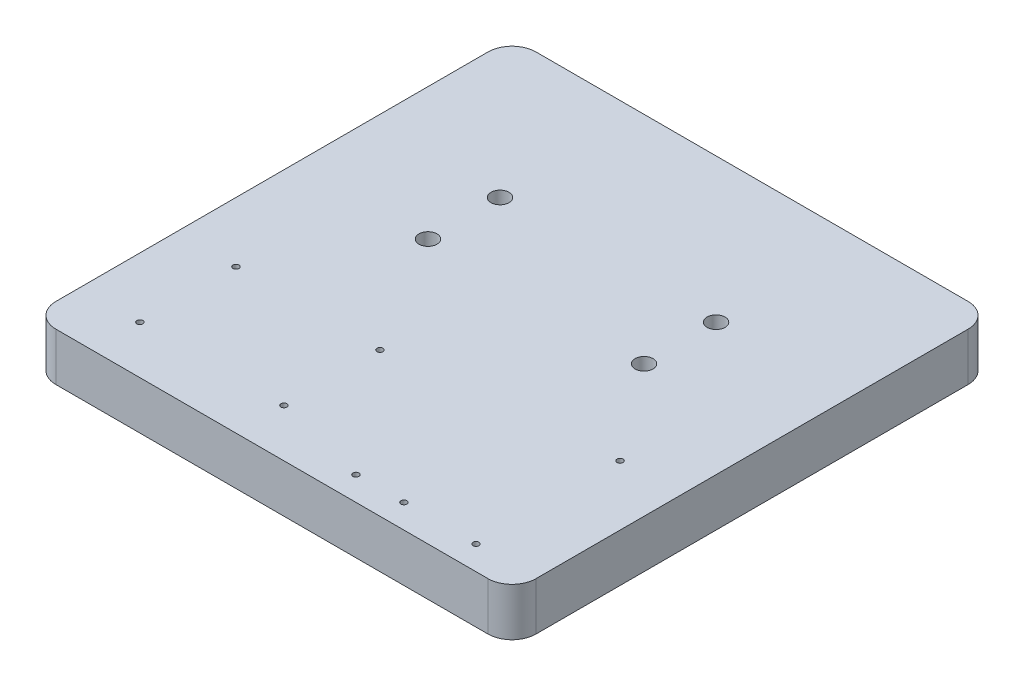
ISO-10303-21;
HEADER;
FILE_DESCRIPTION(('STEP AP214'),'2;1');
FILE_NAME('part.step','',(''),(''),'','','');
FILE_SCHEMA(('AUTOMOTIVE_DESIGN { 1 0 10303 214 1 1 1 1 }'));
ENDSEC;
DATA;
#1=APPLICATION_CONTEXT('core data for automotive mechanical design processes');
#2=APPLICATION_PROTOCOL_DEFINITION('international standard','automotive_design',2000,#1);
#3=PRODUCT_CONTEXT('',#1,'mechanical');
#4=PRODUCT('Part','Part','',(#3));
#5=PRODUCT_RELATED_PRODUCT_CATEGORY('part','',(#4));
#6=PRODUCT_DEFINITION_FORMATION('','',#4);
#7=PRODUCT_DEFINITION_CONTEXT('part definition',#1,'design');
#8=PRODUCT_DEFINITION('design','',#6,#7);
#9=PRODUCT_DEFINITION_SHAPE('','',#8);
#10=(LENGTH_UNIT() NAMED_UNIT(*) SI_UNIT(.MILLI.,.METRE.));
#11=(NAMED_UNIT(*) PLANE_ANGLE_UNIT() SI_UNIT($,.RADIAN.));
#12=(NAMED_UNIT(*) SI_UNIT($,.STERADIAN.) SOLID_ANGLE_UNIT());
#13=UNCERTAINTY_MEASURE_WITH_UNIT(LENGTH_MEASURE(1.E-05),#10,'distance_accuracy_value','');
#14=(GEOMETRIC_REPRESENTATION_CONTEXT(3) GLOBAL_UNCERTAINTY_ASSIGNED_CONTEXT((#13)) GLOBAL_UNIT_ASSIGNED_CONTEXT((#10,
#11,#12)) REPRESENTATION_CONTEXT('',''));
#15=CARTESIAN_POINT('',(0.,0.,0.));
#16=DIRECTION('',(0.,0.,1.));
#17=DIRECTION('',(1.,0.,0.));
#18=AXIS2_PLACEMENT_3D('',#15,#16,#17);
#19=CARTESIAN_POINT('',(100.,20.,100.));
#20=DIRECTION('',(-1.,0.,0.));
#21=DIRECTION('',(0.,0.,1.));
#22=AXIS2_PLACEMENT_3D('',#19,#20,#21);
#23=PLANE('',#22);
#24=DIRECTION('',(0.,0.,-1.));
#25=VECTOR('',#24,1.);
#26=CARTESIAN_POINT('',(100.,20.,100.));
#27=LINE('',#26,#25);
#28=CARTESIAN_POINT('',(100.,20.,90.));
#29=VERTEX_POINT('',#28);
#30=CARTESIAN_POINT('',(100.,20.,-90.));
#31=VERTEX_POINT('',#30);
#32=EDGE_CURVE('E124',#29,#31,#27,.T.);
#33=ORIENTED_EDGE('',*,*,#32,.F.);
#34=DIRECTION('',(0.,-1.,0.));
#35=VECTOR('',#34,1.);
#36=CARTESIAN_POINT('',(100.,20.,90.));
#37=LINE('',#36,#35);
#38=CARTESIAN_POINT('',(100.,0.,90.));
#39=VERTEX_POINT('',#38);
#40=EDGE_CURVE('E150',#29,#39,#37,.T.);
#41=ORIENTED_EDGE('',*,*,#40,.T.);
#42=DIRECTION('',(0.,0.,-1.));
#43=VECTOR('',#42,1.);
#44=CARTESIAN_POINT('',(100.,0.,100.));
#45=LINE('',#44,#43);
#46=CARTESIAN_POINT('',(100.,0.,-90.));
#47=VERTEX_POINT('',#46);
#48=EDGE_CURVE('E156',#39,#47,#45,.T.);
#49=ORIENTED_EDGE('',*,*,#48,.T.);
#50=DIRECTION('',(0.,-1.,0.));
#51=VECTOR('',#50,1.);
#52=CARTESIAN_POINT('',(100.,20.,-90.));
#53=LINE('',#52,#51);
#54=EDGE_CURVE('E148',#47,#31,#53,.F.);
#55=ORIENTED_EDGE('',*,*,#54,.T.);
#56=EDGE_LOOP('',(#33,#41,#49,#55));
#57=FACE_BOUND('',#56,.T.);
#58=ADVANCED_FACE('F32',(#57),#23,.F.);
#59=CARTESIAN_POINT('',(-100.,20.,-100.));
#60=DIRECTION('',(0.,0.,1.));
#61=DIRECTION('',(1.,0.,0.));
#62=AXIS2_PLACEMENT_3D('',#59,#60,#61);
#63=PLANE('',#62);
#64=DIRECTION('',(-1.,0.,0.));
#65=VECTOR('',#64,1.);
#66=CARTESIAN_POINT('',(-100.,20.,-100.));
#67=LINE('',#66,#65);
#68=CARTESIAN_POINT('',(90.,20.,-100.));
#69=VERTEX_POINT('',#68);
#70=CARTESIAN_POINT('',(-90.,20.,-100.));
#71=VERTEX_POINT('',#70);
#72=EDGE_CURVE('E127',#69,#71,#67,.T.);
#73=ORIENTED_EDGE('',*,*,#72,.F.);
#74=DIRECTION('',(0.,-1.,0.));
#75=VECTOR('',#74,1.);
#76=CARTESIAN_POINT('',(90.,20.,-100.));
#77=LINE('',#76,#75);
#78=CARTESIAN_POINT('',(90.,0.,-100.));
#79=VERTEX_POINT('',#78);
#80=EDGE_CURVE('E11',#69,#79,#77,.T.);
#81=ORIENTED_EDGE('',*,*,#80,.T.);
#82=DIRECTION('',(-1.,0.,0.));
#83=VECTOR('',#82,1.);
#84=CARTESIAN_POINT('',(-100.,0.,-100.));
#85=LINE('',#84,#83);
#86=CARTESIAN_POINT('',(-90.,0.,-100.));
#87=VERTEX_POINT('',#86);
#88=EDGE_CURVE('E129',#79,#87,#85,.T.);
#89=ORIENTED_EDGE('',*,*,#88,.T.);
#90=DIRECTION('',(0.,-1.,0.));
#91=VECTOR('',#90,1.);
#92=CARTESIAN_POINT('',(-90.,20.,-100.));
#93=LINE('',#92,#91);
#94=EDGE_CURVE('E40',#87,#71,#93,.F.);
#95=ORIENTED_EDGE('',*,*,#94,.T.);
#96=EDGE_LOOP('',(#73,#81,#89,#95));
#97=FACE_BOUND('',#96,.T.);
#98=ADVANCED_FACE('F281',(#97),#63,.F.);
#99=CARTESIAN_POINT('',(-100.,20.,100.));
#100=DIRECTION('',(1.,0.,0.));
#101=DIRECTION('',(0.,0.,-1.));
#102=AXIS2_PLACEMENT_3D('',#99,#100,#101);
#103=PLANE('',#102);
#104=DIRECTION('',(0.,0.,1.));
#105=VECTOR('',#104,1.);
#106=CARTESIAN_POINT('',(-100.,0.,100.));
#107=LINE('',#106,#105);
#108=CARTESIAN_POINT('',(-100.,0.,-90.));
#109=VERTEX_POINT('',#108);
#110=CARTESIAN_POINT('',(-100.,0.,90.));
#111=VERTEX_POINT('',#110);
#112=EDGE_CURVE('E125',#109,#111,#107,.T.);
#113=ORIENTED_EDGE('',*,*,#112,.T.);
#114=DIRECTION('',(0.,-1.,0.));
#115=VECTOR('',#114,1.);
#116=CARTESIAN_POINT('',(-100.,20.,90.));
#117=LINE('',#116,#115);
#118=CARTESIAN_POINT('',(-100.,20.,90.));
#119=VERTEX_POINT('',#118);
#120=EDGE_CURVE('E103',#111,#119,#117,.F.);
#121=ORIENTED_EDGE('',*,*,#120,.T.);
#122=DIRECTION('',(0.,0.,1.));
#123=VECTOR('',#122,1.);
#124=CARTESIAN_POINT('',(-100.,20.,100.));
#125=LINE('',#124,#123);
#126=CARTESIAN_POINT('',(-100.,20.,-90.));
#127=VERTEX_POINT('',#126);
#128=EDGE_CURVE('E168',#127,#119,#125,.T.);
#129=ORIENTED_EDGE('',*,*,#128,.F.);
#130=DIRECTION('',(0.,-1.,0.));
#131=VECTOR('',#130,1.);
#132=CARTESIAN_POINT('',(-100.,20.,-90.));
#133=LINE('',#132,#131);
#134=EDGE_CURVE('E108',#127,#109,#133,.T.);
#135=ORIENTED_EDGE('',*,*,#134,.T.);
#136=EDGE_LOOP('',(#113,#121,#129,#135));
#137=FACE_BOUND('',#136,.T.);
#138=ADVANCED_FACE('F279',(#137),#103,.F.);
#139=CARTESIAN_POINT('',(-100.,20.,100.));
#140=DIRECTION('',(0.,0.,-1.));
#141=DIRECTION('',(-1.,0.,0.));
#142=AXIS2_PLACEMENT_3D('',#139,#140,#141);
#143=PLANE('',#142);
#144=DIRECTION('',(1.,0.,0.));
#145=VECTOR('',#144,1.);
#146=CARTESIAN_POINT('',(-100.,20.,100.));
#147=LINE('',#146,#145);
#148=CARTESIAN_POINT('',(-90.,20.,100.));
#149=VERTEX_POINT('',#148);
#150=CARTESIAN_POINT('',(90.,20.,100.));
#151=VERTEX_POINT('',#150);
#152=EDGE_CURVE('E118',#149,#151,#147,.T.);
#153=ORIENTED_EDGE('',*,*,#152,.F.);
#154=DIRECTION('',(0.,-1.,0.));
#155=VECTOR('',#154,1.);
#156=CARTESIAN_POINT('',(-90.,20.,100.));
#157=LINE('',#156,#155);
#158=CARTESIAN_POINT('',(-90.,0.,100.));
#159=VERTEX_POINT('',#158);
#160=EDGE_CURVE('E102',#149,#159,#157,.T.);
#161=ORIENTED_EDGE('',*,*,#160,.T.);
#162=DIRECTION('',(1.,0.,0.));
#163=VECTOR('',#162,1.);
#164=CARTESIAN_POINT('',(-100.,0.,100.));
#165=LINE('',#164,#163);
#166=CARTESIAN_POINT('',(90.,0.,100.));
#167=VERTEX_POINT('',#166);
#168=EDGE_CURVE('E115',#159,#167,#165,.T.);
#169=ORIENTED_EDGE('',*,*,#168,.T.);
#170=DIRECTION('',(0.,-1.,0.));
#171=VECTOR('',#170,1.);
#172=CARTESIAN_POINT('',(90.,20.,100.));
#173=LINE('',#172,#171);
#174=EDGE_CURVE('E120',#167,#151,#173,.F.);
#175=ORIENTED_EDGE('',*,*,#174,.T.);
#176=EDGE_LOOP('',(#153,#161,#169,#175));
#177=FACE_BOUND('',#176,.T.);
#178=ADVANCED_FACE('F114',(#177),#143,.F.);
#179=CARTESIAN_POINT('',(0.,20.,0.));
#180=DIRECTION('',(0.,-1.,0.));
#181=DIRECTION('',(0.,0.,-1.));
#182=AXIS2_PLACEMENT_3D('',#179,#180,#181);
#183=PLANE('',#182);
#184=CARTESIAN_POINT('',(75.,20.,30.));
#185=DIRECTION('',(0.,1.,0.));
#186=DIRECTION('',(0.,0.,1.));
#187=AXIS2_PLACEMENT_3D('',#184,#185,#186);
#188=CIRCLE('',#187,1.25);
#189=CARTESIAN_POINT('',(75.,20.,31.25));
#190=VERTEX_POINT('',#189);
#191=EDGE_CURVE('E235',#190,#190,#188,.T.);
#192=ORIENTED_EDGE('',*,*,#191,.F.);
#193=EDGE_LOOP('',(#192));
#194=FACE_BOUND('',#193,.T.);
#195=CARTESIAN_POINT('',(45.,20.,90.));
#196=DIRECTION('',(0.,1.,0.));
#197=DIRECTION('',(0.,0.,1.));
#198=AXIS2_PLACEMENT_3D('',#195,#196,#197);
#199=CIRCLE('',#198,1.25);
#200=CARTESIAN_POINT('',(45.,20.,91.25));
#201=VERTEX_POINT('',#200);
#202=EDGE_CURVE('E229',#201,#201,#199,.T.);
#203=ORIENTED_EDGE('',*,*,#202,.F.);
#204=EDGE_LOOP('',(#203));
#205=FACE_BOUND('',#204,.T.);
#206=CARTESIAN_POINT('',(25.,20.,90.));
#207=DIRECTION('',(0.,1.,0.));
#208=DIRECTION('',(0.,0.,1.));
#209=AXIS2_PLACEMENT_3D('',#206,#207,#208);
#210=CIRCLE('',#209,1.25);
#211=CARTESIAN_POINT('',(25.,20.,91.25));
#212=VERTEX_POINT('',#211);
#213=EDGE_CURVE('E223',#212,#212,#210,.T.);
#214=ORIENTED_EDGE('',*,*,#213,.F.);
#215=EDGE_LOOP('',(#214));
#216=FACE_BOUND('',#215,.T.);
#217=CARTESIAN_POINT('',(-15.,20.,40.));
#218=DIRECTION('',(0.,1.,0.));
#219=DIRECTION('',(0.,0.,1.));
#220=AXIS2_PLACEMENT_3D('',#217,#218,#219);
#221=CIRCLE('',#220,1.25);
#222=CARTESIAN_POINT('',(-15.,20.,41.25));
#223=VERTEX_POINT('',#222);
#224=EDGE_CURVE('E217',#223,#223,#221,.T.);
#225=ORIENTED_EDGE('',*,*,#224,.F.);
#226=EDGE_LOOP('',(#225));
#227=FACE_BOUND('',#226,.T.);
#228=CARTESIAN_POINT('',(-15.,20.,80.));
#229=DIRECTION('',(0.,1.,0.));
#230=DIRECTION('',(0.,0.,1.));
#231=AXIS2_PLACEMENT_3D('',#228,#229,#230);
#232=CIRCLE('',#231,1.25);
#233=CARTESIAN_POINT('',(-15.,20.,81.25));
#234=VERTEX_POINT('',#233);
#235=EDGE_CURVE('E211',#234,#234,#232,.T.);
#236=ORIENTED_EDGE('',*,*,#235,.F.);
#237=EDGE_LOOP('',(#236));
#238=FACE_BOUND('',#237,.T.);
#239=CARTESIAN_POINT('',(-75.,20.,40.));
#240=DIRECTION('',(0.,1.,0.));
#241=DIRECTION('',(0.,0.,-1.));
#242=AXIS2_PLACEMENT_3D('',#239,#240,#241);
#243=CIRCLE('',#242,1.25);
#244=CARTESIAN_POINT('',(-75.,20.,38.75));
#245=VERTEX_POINT('',#244);
#246=EDGE_CURVE('E205',#245,#245,#243,.T.);
#247=ORIENTED_EDGE('',*,*,#246,.F.);
#248=EDGE_LOOP('',(#247));
#249=FACE_BOUND('',#248,.T.);
#250=CARTESIAN_POINT('',(-75.,20.,80.));
#251=DIRECTION('',(0.,1.,0.));
#252=DIRECTION('',(0.,0.,-1.));
#253=AXIS2_PLACEMENT_3D('',#250,#251,#252);
#254=CIRCLE('',#253,1.25);
#255=CARTESIAN_POINT('',(-75.,20.,78.75));
#256=VERTEX_POINT('',#255);
#257=EDGE_CURVE('E199',#256,#256,#254,.T.);
#258=ORIENTED_EDGE('',*,*,#257,.F.);
#259=EDGE_LOOP('',(#258));
#260=FACE_BOUND('',#259,.T.);
#261=CARTESIAN_POINT('',(75.,20.,90.));
#262=DIRECTION('',(0.,1.,0.));
#263=DIRECTION('',(0.,0.,1.));
#264=AXIS2_PLACEMENT_3D('',#261,#262,#263);
#265=CIRCLE('',#264,1.25);
#266=CARTESIAN_POINT('',(75.,20.,91.25));
#267=VERTEX_POINT('',#266);
#268=EDGE_CURVE('E193',#267,#267,#265,.T.);
#269=ORIENTED_EDGE('',*,*,#268,.F.);
#270=EDGE_LOOP('',(#269));
#271=FACE_BOUND('',#270,.T.);
#272=CARTESIAN_POINT('',(45.,20.,-40.));
#273=DIRECTION('',(0.,-1.,0.));
#274=DIRECTION('',(0.,0.,1.));
#275=AXIS2_PLACEMENT_3D('',#272,#273,#274);
#276=CIRCLE('',#275,3.75000000000001);
#277=CARTESIAN_POINT('',(45.,20.,-36.25));
#278=VERTEX_POINT('',#277);
#279=EDGE_CURVE('E187',#278,#278,#276,.T.);
#280=ORIENTED_EDGE('',*,*,#279,.T.);
#281=EDGE_LOOP('',(#280));
#282=FACE_BOUND('',#281,.T.);
#283=CARTESIAN_POINT('',(-45.,20.,-40.));
#284=DIRECTION('',(0.,-1.,0.));
#285=DIRECTION('',(0.,0.,-1.));
#286=AXIS2_PLACEMENT_3D('',#283,#284,#285);
#287=CIRCLE('',#286,3.75000000000001);
#288=CARTESIAN_POINT('',(-45.,20.,-43.75));
#289=VERTEX_POINT('',#288);
#290=EDGE_CURVE('E181',#289,#289,#287,.T.);
#291=ORIENTED_EDGE('',*,*,#290,.T.);
#292=EDGE_LOOP('',(#291));
#293=FACE_BOUND('',#292,.T.);
#294=CARTESIAN_POINT('',(45.,20.,-10.));
#295=DIRECTION('',(0.,1.,0.));
#296=DIRECTION('',(0.,0.,-1.));
#297=AXIS2_PLACEMENT_3D('',#294,#295,#296);
#298=CIRCLE('',#297,3.75000000000001);
#299=CARTESIAN_POINT('',(45.,20.,-13.75));
#300=VERTEX_POINT('',#299);
#301=EDGE_CURVE('E175',#300,#300,#298,.T.);
#302=ORIENTED_EDGE('',*,*,#301,.F.);
#303=EDGE_LOOP('',(#302));
#304=FACE_BOUND('',#303,.T.);
#305=CARTESIAN_POINT('',(-45.,20.,-10.));
#306=DIRECTION('',(0.,1.,0.));
#307=DIRECTION('',(0.,0.,1.));
#308=AXIS2_PLACEMENT_3D('',#305,#306,#307);
#309=CIRCLE('',#308,3.75000000000001);
#310=CARTESIAN_POINT('',(-45.,20.,-6.25));
#311=VERTEX_POINT('',#310);
#312=EDGE_CURVE('E164',#311,#311,#309,.T.);
#313=ORIENTED_EDGE('',*,*,#312,.F.);
#314=EDGE_LOOP('',(#313));
#315=FACE_BOUND('',#314,.T.);
#316=ORIENTED_EDGE('',*,*,#128,.T.);
#317=CARTESIAN_POINT('',(-90.,20.,90.));
#318=DIRECTION('',(0.,-1.,0.));
#319=DIRECTION('',(0.,0.,-1.));
#320=AXIS2_PLACEMENT_3D('',#317,#318,#319);
#321=CIRCLE('',#320,10.);
#322=EDGE_CURVE('E146',#119,#149,#321,.F.);
#323=ORIENTED_EDGE('',*,*,#322,.T.);
#324=ORIENTED_EDGE('',*,*,#152,.T.);
#325=CARTESIAN_POINT('',(90.,20.,90.));
#326=DIRECTION('',(0.,-1.,0.));
#327=DIRECTION('',(0.,0.,-1.));
#328=AXIS2_PLACEMENT_3D('',#325,#326,#327);
#329=CIRCLE('',#328,10.);
#330=EDGE_CURVE('E144',#151,#29,#329,.F.);
#331=ORIENTED_EDGE('',*,*,#330,.T.);
#332=ORIENTED_EDGE('',*,*,#32,.T.);
#333=CARTESIAN_POINT('',(90.,20.,-90.));
#334=DIRECTION('',(0.,-1.,0.));
#335=DIRECTION('',(0.,0.,-1.));
#336=AXIS2_PLACEMENT_3D('',#333,#334,#335);
#337=CIRCLE('',#336,10.);
#338=EDGE_CURVE('E53',#31,#69,#337,.F.);
#339=ORIENTED_EDGE('',*,*,#338,.T.);
#340=ORIENTED_EDGE('',*,*,#72,.T.);
#341=CARTESIAN_POINT('',(-90.,20.,-90.));
#342=DIRECTION('',(0.,-1.,0.));
#343=DIRECTION('',(0.,0.,-1.));
#344=AXIS2_PLACEMENT_3D('',#341,#342,#343);
#345=CIRCLE('',#344,10.);
#346=EDGE_CURVE('E141',#71,#127,#345,.F.);
#347=ORIENTED_EDGE('',*,*,#346,.T.);
#348=EDGE_LOOP('',(#316,#323,#324,#331,#332,#339,#340,#347));
#349=FACE_BOUND('',#348,.T.);
#350=ADVANCED_FACE('F250',(#194,#205,#216,#227,#238,#249,#260,#271,#282,#293,#304,#315,#349),
#183,.F.);
#351=CARTESIAN_POINT('',(0.,0.,0.));
#352=DIRECTION('',(0.,-1.,0.));
#353=DIRECTION('',(0.,0.,-1.));
#354=AXIS2_PLACEMENT_3D('',#351,#352,#353);
#355=PLANE('',#354);
#356=CARTESIAN_POINT('',(75.,0.,30.));
#357=DIRECTION('',(0.,1.,0.));
#358=DIRECTION('',(0.,0.,1.));
#359=AXIS2_PLACEMENT_3D('',#356,#357,#358);
#360=CIRCLE('',#359,1.25);
#361=CARTESIAN_POINT('',(75.,0.,31.25));
#362=VERTEX_POINT('',#361);
#363=EDGE_CURVE('E196',#362,#362,#360,.T.);
#364=ORIENTED_EDGE('',*,*,#363,.T.);
#365=EDGE_LOOP('',(#364));
#366=FACE_BOUND('',#365,.T.);
#367=CARTESIAN_POINT('',(45.,0.,90.));
#368=DIRECTION('',(0.,1.,0.));
#369=DIRECTION('',(0.,0.,1.));
#370=AXIS2_PLACEMENT_3D('',#367,#368,#369);
#371=CIRCLE('',#370,1.25);
#372=CARTESIAN_POINT('',(45.,0.,91.25));
#373=VERTEX_POINT('',#372);
#374=EDGE_CURVE('E232',#373,#373,#371,.T.);
#375=ORIENTED_EDGE('',*,*,#374,.T.);
#376=EDGE_LOOP('',(#375));
#377=FACE_BOUND('',#376,.T.);
#378=CARTESIAN_POINT('',(25.,0.,90.));
#379=DIRECTION('',(0.,1.,0.));
#380=DIRECTION('',(0.,0.,1.));
#381=AXIS2_PLACEMENT_3D('',#378,#379,#380);
#382=CIRCLE('',#381,1.25);
#383=CARTESIAN_POINT('',(25.,0.,91.25));
#384=VERTEX_POINT('',#383);
#385=EDGE_CURVE('E226',#384,#384,#382,.T.);
#386=ORIENTED_EDGE('',*,*,#385,.T.);
#387=EDGE_LOOP('',(#386));
#388=FACE_BOUND('',#387,.T.);
#389=CARTESIAN_POINT('',(-15.,0.,40.));
#390=DIRECTION('',(0.,1.,0.));
#391=DIRECTION('',(0.,0.,1.));
#392=AXIS2_PLACEMENT_3D('',#389,#390,#391);
#393=CIRCLE('',#392,1.25);
#394=CARTESIAN_POINT('',(-15.,0.,41.25));
#395=VERTEX_POINT('',#394);
#396=EDGE_CURVE('E220',#395,#395,#393,.T.);
#397=ORIENTED_EDGE('',*,*,#396,.T.);
#398=EDGE_LOOP('',(#397));
#399=FACE_BOUND('',#398,.T.);
#400=CARTESIAN_POINT('',(-15.,0.,80.));
#401=DIRECTION('',(0.,1.,0.));
#402=DIRECTION('',(0.,0.,1.));
#403=AXIS2_PLACEMENT_3D('',#400,#401,#402);
#404=CIRCLE('',#403,1.25);
#405=CARTESIAN_POINT('',(-15.,0.,81.25));
#406=VERTEX_POINT('',#405);
#407=EDGE_CURVE('E214',#406,#406,#404,.T.);
#408=ORIENTED_EDGE('',*,*,#407,.T.);
#409=EDGE_LOOP('',(#408));
#410=FACE_BOUND('',#409,.T.);
#411=CARTESIAN_POINT('',(-75.,0.,40.));
#412=DIRECTION('',(0.,1.,0.));
#413=DIRECTION('',(0.,0.,-1.));
#414=AXIS2_PLACEMENT_3D('',#411,#412,#413);
#415=CIRCLE('',#414,1.25);
#416=CARTESIAN_POINT('',(-75.,0.,38.75));
#417=VERTEX_POINT('',#416);
#418=EDGE_CURVE('E208',#417,#417,#415,.T.);
#419=ORIENTED_EDGE('',*,*,#418,.T.);
#420=EDGE_LOOP('',(#419));
#421=FACE_BOUND('',#420,.T.);
#422=CARTESIAN_POINT('',(-75.,0.,80.));
#423=DIRECTION('',(0.,1.,0.));
#424=DIRECTION('',(0.,0.,-1.));
#425=AXIS2_PLACEMENT_3D('',#422,#423,#424);
#426=CIRCLE('',#425,1.25);
#427=CARTESIAN_POINT('',(-75.,0.,78.75));
#428=VERTEX_POINT('',#427);
#429=EDGE_CURVE('E202',#428,#428,#426,.T.);
#430=ORIENTED_EDGE('',*,*,#429,.T.);
#431=EDGE_LOOP('',(#430));
#432=FACE_BOUND('',#431,.T.);
#433=CARTESIAN_POINT('',(75.,0.,90.));
#434=DIRECTION('',(0.,1.,0.));
#435=DIRECTION('',(0.,0.,1.));
#436=AXIS2_PLACEMENT_3D('',#433,#434,#435);
#437=CIRCLE('',#436,1.25);
#438=CARTESIAN_POINT('',(75.,0.,91.25));
#439=VERTEX_POINT('',#438);
#440=EDGE_CURVE('E190',#439,#439,#437,.T.);
#441=ORIENTED_EDGE('',*,*,#440,.T.);
#442=EDGE_LOOP('',(#441));
#443=FACE_BOUND('',#442,.T.);
#444=CARTESIAN_POINT('',(45.,0.,-40.));
#445=DIRECTION('',(0.,-1.,0.));
#446=DIRECTION('',(0.,0.,1.));
#447=AXIS2_PLACEMENT_3D('',#444,#445,#446);
#448=CIRCLE('',#447,3.75000000000001);
#449=CARTESIAN_POINT('',(45.,0.,-36.25));
#450=VERTEX_POINT('',#449);
#451=EDGE_CURVE('E184',#450,#450,#448,.T.);
#452=ORIENTED_EDGE('',*,*,#451,.F.);
#453=EDGE_LOOP('',(#452));
#454=FACE_BOUND('',#453,.T.);
#455=CARTESIAN_POINT('',(-45.,0.,-40.));
#456=DIRECTION('',(0.,-1.,0.));
#457=DIRECTION('',(0.,0.,-1.));
#458=AXIS2_PLACEMENT_3D('',#455,#456,#457);
#459=CIRCLE('',#458,3.75000000000001);
#460=CARTESIAN_POINT('',(-45.,0.,-43.75));
#461=VERTEX_POINT('',#460);
#462=EDGE_CURVE('E178',#461,#461,#459,.T.);
#463=ORIENTED_EDGE('',*,*,#462,.F.);
#464=EDGE_LOOP('',(#463));
#465=FACE_BOUND('',#464,.T.);
#466=CARTESIAN_POINT('',(45.,0.,-10.));
#467=DIRECTION('',(0.,1.,0.));
#468=DIRECTION('',(0.,0.,-1.));
#469=AXIS2_PLACEMENT_3D('',#466,#467,#468);
#470=CIRCLE('',#469,3.75000000000001);
#471=CARTESIAN_POINT('',(45.,0.,-13.75));
#472=VERTEX_POINT('',#471);
#473=EDGE_CURVE('E173',#472,#472,#470,.T.);
#474=ORIENTED_EDGE('',*,*,#473,.T.);
#475=EDGE_LOOP('',(#474));
#476=FACE_BOUND('',#475,.T.);
#477=CARTESIAN_POINT('',(-45.,0.,-10.));
#478=DIRECTION('',(0.,1.,0.));
#479=DIRECTION('',(0.,0.,1.));
#480=AXIS2_PLACEMENT_3D('',#477,#478,#479);
#481=CIRCLE('',#480,3.75000000000001);
#482=CARTESIAN_POINT('',(-45.,0.,-6.25));
#483=VERTEX_POINT('',#482);
#484=EDGE_CURVE('E161',#483,#483,#481,.T.);
#485=ORIENTED_EDGE('',*,*,#484,.T.);
#486=EDGE_LOOP('',(#485));
#487=FACE_BOUND('',#486,.T.);
#488=ORIENTED_EDGE('',*,*,#168,.F.);
#489=CARTESIAN_POINT('',(-90.,0.,90.));
#490=DIRECTION('',(0.,-1.,0.));
#491=DIRECTION('',(0.,0.,-1.));
#492=AXIS2_PLACEMENT_3D('',#489,#490,#491);
#493=CIRCLE('',#492,10.);
#494=EDGE_CURVE('E98',#159,#111,#493,.T.);
#495=ORIENTED_EDGE('',*,*,#494,.T.);
#496=ORIENTED_EDGE('',*,*,#112,.F.);
#497=CARTESIAN_POINT('',(-90.,0.,-90.));
#498=DIRECTION('',(0.,-1.,0.));
#499=DIRECTION('',(0.,0.,-1.));
#500=AXIS2_PLACEMENT_3D('',#497,#498,#499);
#501=CIRCLE('',#500,10.);
#502=EDGE_CURVE('E119',#109,#87,#501,.T.);
#503=ORIENTED_EDGE('',*,*,#502,.T.);
#504=ORIENTED_EDGE('',*,*,#88,.F.);
#505=CARTESIAN_POINT('',(90.,0.,-90.));
#506=DIRECTION('',(0.,-1.,0.));
#507=DIRECTION('',(0.,0.,-1.));
#508=AXIS2_PLACEMENT_3D('',#505,#506,#507);
#509=CIRCLE('',#508,10.);
#510=EDGE_CURVE('E135',#79,#47,#509,.T.);
#511=ORIENTED_EDGE('',*,*,#510,.T.);
#512=ORIENTED_EDGE('',*,*,#48,.F.);
#513=CARTESIAN_POINT('',(90.,0.,90.));
#514=DIRECTION('',(0.,-1.,0.));
#515=DIRECTION('',(0.,0.,-1.));
#516=AXIS2_PLACEMENT_3D('',#513,#514,#515);
#517=CIRCLE('',#516,10.);
#518=EDGE_CURVE('E109',#39,#167,#517,.T.);
#519=ORIENTED_EDGE('',*,*,#518,.T.);
#520=EDGE_LOOP('',(#488,#495,#496,#503,#504,#511,#512,#519));
#521=FACE_BOUND('',#520,.T.);
#522=ADVANCED_FACE('F122',(#366,#377,#388,#399,#410,#421,#432,#443,#454,#465,#476,#487,#521),
#355,.T.);
#523=CARTESIAN_POINT('',(-90.,20.,90.));
#524=DIRECTION('',(0.,-1.,0.));
#525=DIRECTION('',(0.,0.,-1.));
#526=AXIS2_PLACEMENT_3D('',#523,#524,#525);
#527=CYLINDRICAL_SURFACE('',#526,10.);
#528=ORIENTED_EDGE('',*,*,#322,.F.);
#529=ORIENTED_EDGE('',*,*,#120,.F.);
#530=ORIENTED_EDGE('',*,*,#494,.F.);
#531=ORIENTED_EDGE('',*,*,#160,.F.);
#532=EDGE_LOOP('',(#528,#529,#530,#531));
#533=FACE_BOUND('',#532,.T.);
#534=ADVANCED_FACE('F101',(#533),#527,.T.);
#535=CARTESIAN_POINT('',(90.,20.,90.));
#536=DIRECTION('',(0.,-1.,0.));
#537=DIRECTION('',(0.,0.,-1.));
#538=AXIS2_PLACEMENT_3D('',#535,#536,#537);
#539=CYLINDRICAL_SURFACE('',#538,10.);
#540=ORIENTED_EDGE('',*,*,#330,.F.);
#541=ORIENTED_EDGE('',*,*,#174,.F.);
#542=ORIENTED_EDGE('',*,*,#518,.F.);
#543=ORIENTED_EDGE('',*,*,#40,.F.);
#544=EDGE_LOOP('',(#540,#541,#542,#543));
#545=FACE_BOUND('',#544,.T.);
#546=ADVANCED_FACE('F285',(#545),#539,.T.);
#547=CARTESIAN_POINT('',(90.,20.,-90.));
#548=DIRECTION('',(0.,-1.,0.));
#549=DIRECTION('',(0.,0.,-1.));
#550=AXIS2_PLACEMENT_3D('',#547,#548,#549);
#551=CYLINDRICAL_SURFACE('',#550,10.);
#552=ORIENTED_EDGE('',*,*,#338,.F.);
#553=ORIENTED_EDGE('',*,*,#54,.F.);
#554=ORIENTED_EDGE('',*,*,#510,.F.);
#555=ORIENTED_EDGE('',*,*,#80,.F.);
#556=EDGE_LOOP('',(#552,#553,#554,#555));
#557=FACE_BOUND('',#556,.T.);
#558=ADVANCED_FACE('F284',(#557),#551,.T.);
#559=CARTESIAN_POINT('',(-90.,20.,-90.));
#560=DIRECTION('',(0.,-1.,0.));
#561=DIRECTION('',(0.,0.,-1.));
#562=AXIS2_PLACEMENT_3D('',#559,#560,#561);
#563=CYLINDRICAL_SURFACE('',#562,10.);
#564=ORIENTED_EDGE('',*,*,#346,.F.);
#565=ORIENTED_EDGE('',*,*,#94,.F.);
#566=ORIENTED_EDGE('',*,*,#502,.F.);
#567=ORIENTED_EDGE('',*,*,#134,.F.);
#568=EDGE_LOOP('',(#564,#565,#566,#567));
#569=FACE_BOUND('',#568,.T.);
#570=ADVANCED_FACE('F34',(#569),#563,.T.);
#571=CARTESIAN_POINT('',(-45.,0.,-10.));
#572=DIRECTION('',(0.,1.,0.));
#573=DIRECTION('',(0.,0.,1.));
#574=AXIS2_PLACEMENT_3D('',#571,#572,#573);
#575=CYLINDRICAL_SURFACE('',#574,3.75000000000001);
#576=ORIENTED_EDGE('',*,*,#484,.F.);
#577=EDGE_LOOP('',(#576));
#578=FACE_BOUND('',#577,.T.);
#579=ORIENTED_EDGE('',*,*,#312,.T.);
#580=EDGE_LOOP('',(#579));
#581=FACE_BOUND('',#580,.T.);
#582=ADVANCED_FACE('F306',(#578,#581),#575,.F.);
#583=CARTESIAN_POINT('',(45.,0.,-10.));
#584=DIRECTION('',(0.,1.,0.));
#585=DIRECTION('',(0.,0.,1.));
#586=AXIS2_PLACEMENT_3D('',#583,#584,#585);
#587=CYLINDRICAL_SURFACE('',#586,3.75000000000001);
#588=ORIENTED_EDGE('',*,*,#473,.F.);
#589=EDGE_LOOP('',(#588));
#590=FACE_BOUND('',#589,.T.);
#591=ORIENTED_EDGE('',*,*,#301,.T.);
#592=EDGE_LOOP('',(#591));
#593=FACE_BOUND('',#592,.T.);
#594=ADVANCED_FACE('F309',(#590,#593),#587,.F.);
#595=CARTESIAN_POINT('',(-45.,0.,-40.));
#596=DIRECTION('',(0.,1.,0.));
#597=DIRECTION('',(0.,0.,1.));
#598=AXIS2_PLACEMENT_3D('',#595,#596,#597);
#599=CYLINDRICAL_SURFACE('',#598,3.75000000000001);
#600=ORIENTED_EDGE('',*,*,#462,.T.);
#601=EDGE_LOOP('',(#600));
#602=FACE_BOUND('',#601,.T.);
#603=ORIENTED_EDGE('',*,*,#290,.F.);
#604=EDGE_LOOP('',(#603));
#605=FACE_BOUND('',#604,.T.);
#606=ADVANCED_FACE('F313',(#602,#605),#599,.F.);
#607=CARTESIAN_POINT('',(45.,0.,-40.));
#608=DIRECTION('',(0.,1.,0.));
#609=DIRECTION('',(0.,0.,1.));
#610=AXIS2_PLACEMENT_3D('',#607,#608,#609);
#611=CYLINDRICAL_SURFACE('',#610,3.75000000000001);
#612=ORIENTED_EDGE('',*,*,#451,.T.);
#613=EDGE_LOOP('',(#612));
#614=FACE_BOUND('',#613,.T.);
#615=ORIENTED_EDGE('',*,*,#279,.F.);
#616=EDGE_LOOP('',(#615));
#617=FACE_BOUND('',#616,.T.);
#618=ADVANCED_FACE('F317',(#614,#617),#611,.F.);
#619=CARTESIAN_POINT('',(75.,0.,90.));
#620=DIRECTION('',(0.,1.,0.));
#621=DIRECTION('',(0.,0.,1.));
#622=AXIS2_PLACEMENT_3D('',#619,#620,#621);
#623=CYLINDRICAL_SURFACE('',#622,1.25);
#624=ORIENTED_EDGE('',*,*,#440,.F.);
#625=EDGE_LOOP('',(#624));
#626=FACE_BOUND('',#625,.T.);
#627=ORIENTED_EDGE('',*,*,#268,.T.);
#628=EDGE_LOOP('',(#627));
#629=FACE_BOUND('',#628,.T.);
#630=ADVANCED_FACE('F321',(#626,#629),#623,.F.);
#631=CARTESIAN_POINT('',(-75.,0.,80.));
#632=DIRECTION('',(0.,1.,0.));
#633=DIRECTION('',(0.,0.,1.));
#634=AXIS2_PLACEMENT_3D('',#631,#632,#633);
#635=CYLINDRICAL_SURFACE('',#634,1.25);
#636=ORIENTED_EDGE('',*,*,#429,.F.);
#637=EDGE_LOOP('',(#636));
#638=FACE_BOUND('',#637,.T.);
#639=ORIENTED_EDGE('',*,*,#257,.T.);
#640=EDGE_LOOP('',(#639));
#641=FACE_BOUND('',#640,.T.);
#642=ADVANCED_FACE('F325',(#638,#641),#635,.F.);
#643=CARTESIAN_POINT('',(-75.,0.,40.));
#644=DIRECTION('',(0.,1.,0.));
#645=DIRECTION('',(0.,0.,1.));
#646=AXIS2_PLACEMENT_3D('',#643,#644,#645);
#647=CYLINDRICAL_SURFACE('',#646,1.25);
#648=ORIENTED_EDGE('',*,*,#418,.F.);
#649=EDGE_LOOP('',(#648));
#650=FACE_BOUND('',#649,.T.);
#651=ORIENTED_EDGE('',*,*,#246,.T.);
#652=EDGE_LOOP('',(#651));
#653=FACE_BOUND('',#652,.T.);
#654=ADVANCED_FACE('F329',(#650,#653),#647,.F.);
#655=CARTESIAN_POINT('',(-15.,0.,80.));
#656=DIRECTION('',(0.,1.,0.));
#657=DIRECTION('',(0.,0.,1.));
#658=AXIS2_PLACEMENT_3D('',#655,#656,#657);
#659=CYLINDRICAL_SURFACE('',#658,1.25);
#660=ORIENTED_EDGE('',*,*,#407,.F.);
#661=EDGE_LOOP('',(#660));
#662=FACE_BOUND('',#661,.T.);
#663=ORIENTED_EDGE('',*,*,#235,.T.);
#664=EDGE_LOOP('',(#663));
#665=FACE_BOUND('',#664,.T.);
#666=ADVANCED_FACE('F333',(#662,#665),#659,.F.);
#667=CARTESIAN_POINT('',(-15.,0.,40.));
#668=DIRECTION('',(0.,1.,0.));
#669=DIRECTION('',(0.,0.,1.));
#670=AXIS2_PLACEMENT_3D('',#667,#668,#669);
#671=CYLINDRICAL_SURFACE('',#670,1.25);
#672=ORIENTED_EDGE('',*,*,#396,.F.);
#673=EDGE_LOOP('',(#672));
#674=FACE_BOUND('',#673,.T.);
#675=ORIENTED_EDGE('',*,*,#224,.T.);
#676=EDGE_LOOP('',(#675));
#677=FACE_BOUND('',#676,.T.);
#678=ADVANCED_FACE('F337',(#674,#677),#671,.F.);
#679=CARTESIAN_POINT('',(25.,0.,90.));
#680=DIRECTION('',(0.,1.,0.));
#681=DIRECTION('',(0.,0.,1.));
#682=AXIS2_PLACEMENT_3D('',#679,#680,#681);
#683=CYLINDRICAL_SURFACE('',#682,1.25);
#684=ORIENTED_EDGE('',*,*,#385,.F.);
#685=EDGE_LOOP('',(#684));
#686=FACE_BOUND('',#685,.T.);
#687=ORIENTED_EDGE('',*,*,#213,.T.);
#688=EDGE_LOOP('',(#687));
#689=FACE_BOUND('',#688,.T.);
#690=ADVANCED_FACE('F341',(#686,#689),#683,.F.);
#691=CARTESIAN_POINT('',(45.,0.,90.));
#692=DIRECTION('',(0.,1.,0.));
#693=DIRECTION('',(0.,0.,1.));
#694=AXIS2_PLACEMENT_3D('',#691,#692,#693);
#695=CYLINDRICAL_SURFACE('',#694,1.25);
#696=ORIENTED_EDGE('',*,*,#374,.F.);
#697=EDGE_LOOP('',(#696));
#698=FACE_BOUND('',#697,.T.);
#699=ORIENTED_EDGE('',*,*,#202,.T.);
#700=EDGE_LOOP('',(#699));
#701=FACE_BOUND('',#700,.T.);
#702=ADVANCED_FACE('F246',(#698,#701),#695,.F.);
#703=CARTESIAN_POINT('',(75.,0.,30.));
#704=DIRECTION('',(0.,1.,0.));
#705=DIRECTION('',(0.,0.,1.));
#706=AXIS2_PLACEMENT_3D('',#703,#704,#705);
#707=CYLINDRICAL_SURFACE('',#706,1.25);
#708=ORIENTED_EDGE('',*,*,#363,.F.);
#709=EDGE_LOOP('',(#708));
#710=FACE_BOUND('',#709,.T.);
#711=ORIENTED_EDGE('',*,*,#191,.T.);
#712=EDGE_LOOP('',(#711));
#713=FACE_BOUND('',#712,.T.);
#714=ADVANCED_FACE('F243',(#710,#713),#707,.F.);
#715=CLOSED_SHELL('',(#58,#98,#138,#178,#350,#522,#534,#546,#558,#570,#582,#594,#606,#618,#630,
#642,#654,#666,#678,#690,#702,#714));
#716=MANIFOLD_SOLID_BREP('B2',#715);
#717=ADVANCED_BREP_SHAPE_REPRESENTATION('',(#18,#716),#14);
#718=SHAPE_DEFINITION_REPRESENTATION(#9,#717);
ENDSEC;
END-ISO-10303-21;
